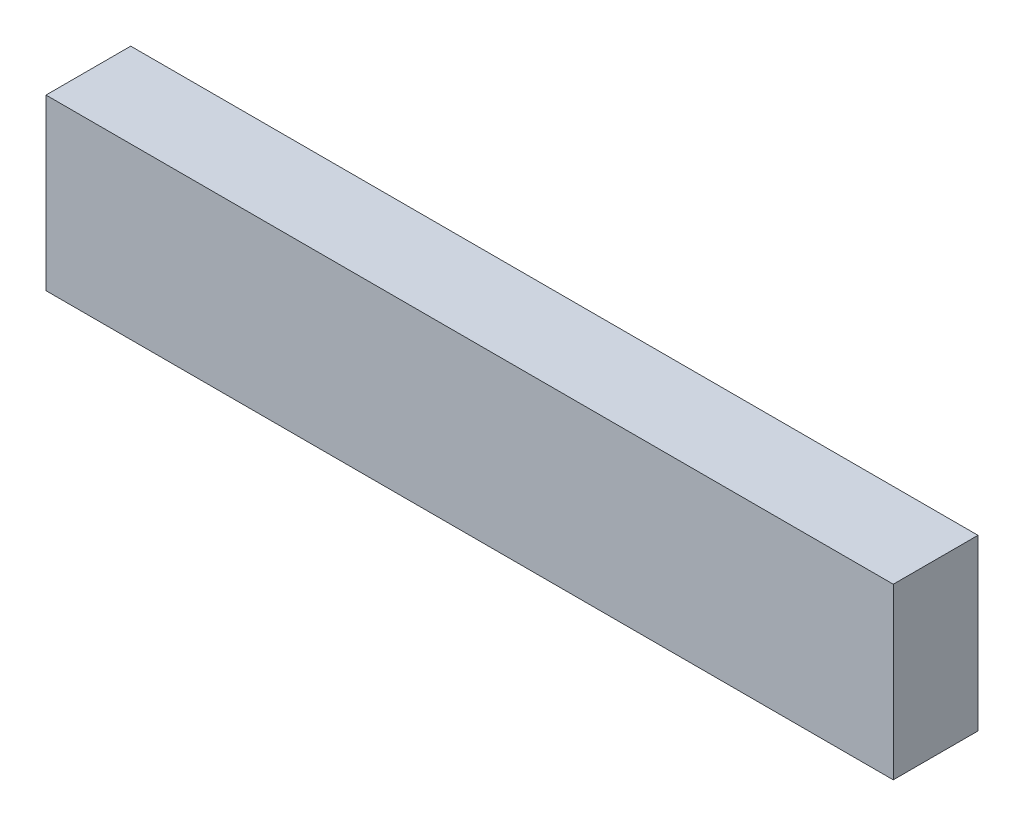
ISO-10303-21;
HEADER;
FILE_DESCRIPTION(('STEP AP214'),'2;1');
FILE_NAME('part.step','',(''),(''),'','','');
FILE_SCHEMA(('AUTOMOTIVE_DESIGN { 1 0 10303 214 1 1 1 1 }'));
ENDSEC;
DATA;
#1=APPLICATION_CONTEXT('core data for automotive mechanical design processes');
#2=APPLICATION_PROTOCOL_DEFINITION('international standard','automotive_design',2000,#1);
#3=PRODUCT_CONTEXT('',#1,'mechanical');
#4=PRODUCT('Part','Part','',(#3));
#5=PRODUCT_RELATED_PRODUCT_CATEGORY('part','',(#4));
#6=PRODUCT_DEFINITION_FORMATION('','',#4);
#7=PRODUCT_DEFINITION_CONTEXT('part definition',#1,'design');
#8=PRODUCT_DEFINITION('design','',#6,#7);
#9=PRODUCT_DEFINITION_SHAPE('','',#8);
#10=(LENGTH_UNIT() NAMED_UNIT(*) SI_UNIT(.MILLI.,.METRE.));
#11=(NAMED_UNIT(*) PLANE_ANGLE_UNIT() SI_UNIT($,.RADIAN.));
#12=(NAMED_UNIT(*) SI_UNIT($,.STERADIAN.) SOLID_ANGLE_UNIT());
#13=UNCERTAINTY_MEASURE_WITH_UNIT(LENGTH_MEASURE(1.E-05),#10,'distance_accuracy_value','');
#14=(GEOMETRIC_REPRESENTATION_CONTEXT(3) GLOBAL_UNCERTAINTY_ASSIGNED_CONTEXT((#13)) GLOBAL_UNIT_ASSIGNED_CONTEXT((#10,
#11,#12)) REPRESENTATION_CONTEXT('',''));
#15=CARTESIAN_POINT('',(0.,0.,0.));
#16=DIRECTION('',(0.,0.,1.));
#17=DIRECTION('',(1.,0.,0.));
#18=AXIS2_PLACEMENT_3D('',#15,#16,#17);
#19=CARTESIAN_POINT('',(0.,0.,5.));
#20=DIRECTION('',(1.,0.,0.));
#21=DIRECTION('',(0.,0.,-1.));
#22=AXIS2_PLACEMENT_3D('',#19,#20,#21);
#23=PLANE('',#22);
#24=DIRECTION('',(0.,-1.,0.));
#25=VECTOR('',#24,1.);
#26=CARTESIAN_POINT('',(0.,0.,0.));
#27=LINE('',#26,#25);
#28=CARTESIAN_POINT('',(0.,0.,0.));
#29=VERTEX_POINT('',#28);
#30=CARTESIAN_POINT('',(0.,-10.,0.));
#31=VERTEX_POINT('',#30);
#32=EDGE_CURVE('E107',#29,#31,#27,.T.);
#33=ORIENTED_EDGE('',*,*,#32,.T.);
#34=DIRECTION('',(0.,0.,-1.));
#35=VECTOR('',#34,1.);
#36=CARTESIAN_POINT('',(0.,-10.,5.));
#37=LINE('',#36,#35);
#38=CARTESIAN_POINT('',(0.,-10.,5.));
#39=VERTEX_POINT('',#38);
#40=EDGE_CURVE('E11',#39,#31,#37,.T.);
#41=ORIENTED_EDGE('',*,*,#40,.F.);
#42=DIRECTION('',(0.,-1.,0.));
#43=VECTOR('',#42,1.);
#44=CARTESIAN_POINT('',(0.,0.,5.));
#45=LINE('',#44,#43);
#46=CARTESIAN_POINT('',(0.,0.,5.));
#47=VERTEX_POINT('',#46);
#48=EDGE_CURVE('E91',#47,#39,#45,.T.);
#49=ORIENTED_EDGE('',*,*,#48,.F.);
#50=DIRECTION('',(0.,0.,-1.));
#51=VECTOR('',#50,1.);
#52=CARTESIAN_POINT('',(0.,0.,5.));
#53=LINE('',#52,#51);
#54=EDGE_CURVE('E103',#47,#29,#53,.T.);
#55=ORIENTED_EDGE('',*,*,#54,.T.);
#56=EDGE_LOOP('',(#33,#41,#49,#55));
#57=FACE_BOUND('',#56,.T.);
#58=ADVANCED_FACE('F39',(#57),#23,.F.);
#59=CARTESIAN_POINT('',(0.,-10.,5.));
#60=DIRECTION('',(0.,1.,0.));
#61=DIRECTION('',(0.,0.,1.));
#62=AXIS2_PLACEMENT_3D('',#59,#60,#61);
#63=PLANE('',#62);
#64=DIRECTION('',(1.,0.,0.));
#65=VECTOR('',#64,1.);
#66=CARTESIAN_POINT('',(0.,-10.,0.));
#67=LINE('',#66,#65);
#68=CARTESIAN_POINT('',(50.,-10.,0.));
#69=VERTEX_POINT('',#68);
#70=EDGE_CURVE('E96',#31,#69,#67,.T.);
#71=ORIENTED_EDGE('',*,*,#70,.T.);
#72=DIRECTION('',(0.,0.,-1.));
#73=VECTOR('',#72,1.);
#74=CARTESIAN_POINT('',(50.,-10.,5.));
#75=LINE('',#74,#73);
#76=CARTESIAN_POINT('',(50.,-10.,5.));
#77=VERTEX_POINT('',#76);
#78=EDGE_CURVE('E48',#77,#69,#75,.T.);
#79=ORIENTED_EDGE('',*,*,#78,.F.);
#80=DIRECTION('',(1.,0.,0.));
#81=VECTOR('',#80,1.);
#82=CARTESIAN_POINT('',(0.,-10.,5.));
#83=LINE('',#82,#81);
#84=EDGE_CURVE('E86',#39,#77,#83,.T.);
#85=ORIENTED_EDGE('',*,*,#84,.F.);
#86=ORIENTED_EDGE('',*,*,#40,.T.);
#87=EDGE_LOOP('',(#71,#79,#85,#86));
#88=FACE_BOUND('',#87,.T.);
#89=ADVANCED_FACE('F95',(#88),#63,.F.);
#90=CARTESIAN_POINT('',(50.,0.,5.));
#91=DIRECTION('',(-1.,0.,0.));
#92=DIRECTION('',(0.,0.,1.));
#93=AXIS2_PLACEMENT_3D('',#90,#91,#92);
#94=PLANE('',#93);
#95=DIRECTION('',(0.,1.,0.));
#96=VECTOR('',#95,1.);
#97=CARTESIAN_POINT('',(50.,0.,0.));
#98=LINE('',#97,#96);
#99=CARTESIAN_POINT('',(50.,0.,0.));
#100=VERTEX_POINT('',#99);
#101=EDGE_CURVE('E73',#69,#100,#98,.T.);
#102=ORIENTED_EDGE('',*,*,#101,.T.);
#103=DIRECTION('',(0.,0.,-1.));
#104=VECTOR('',#103,1.);
#105=CARTESIAN_POINT('',(50.,0.,5.));
#106=LINE('',#105,#104);
#107=CARTESIAN_POINT('',(50.,0.,5.));
#108=VERTEX_POINT('',#107);
#109=EDGE_CURVE('E98',#108,#100,#106,.T.);
#110=ORIENTED_EDGE('',*,*,#109,.F.);
#111=DIRECTION('',(0.,1.,0.));
#112=VECTOR('',#111,1.);
#113=CARTESIAN_POINT('',(50.,0.,5.));
#114=LINE('',#113,#112);
#115=EDGE_CURVE('E89',#77,#108,#114,.T.);
#116=ORIENTED_EDGE('',*,*,#115,.F.);
#117=ORIENTED_EDGE('',*,*,#78,.T.);
#118=EDGE_LOOP('',(#102,#110,#116,#117));
#119=FACE_BOUND('',#118,.T.);
#120=ADVANCED_FACE('F99',(#119),#94,.F.);
#121=CARTESIAN_POINT('',(0.,0.,5.));
#122=DIRECTION('',(0.,-1.,0.));
#123=DIRECTION('',(0.,0.,-1.));
#124=AXIS2_PLACEMENT_3D('',#121,#122,#123);
#125=PLANE('',#124);
#126=DIRECTION('',(-1.,0.,0.));
#127=VECTOR('',#126,1.);
#128=CARTESIAN_POINT('',(0.,0.,0.));
#129=LINE('',#128,#127);
#130=EDGE_CURVE('E79',#100,#29,#129,.T.);
#131=ORIENTED_EDGE('',*,*,#130,.T.);
#132=ORIENTED_EDGE('',*,*,#54,.F.);
#133=DIRECTION('',(-1.,0.,0.));
#134=VECTOR('',#133,1.);
#135=CARTESIAN_POINT('',(0.,0.,5.));
#136=LINE('',#135,#134);
#137=EDGE_CURVE('E56',#108,#47,#136,.T.);
#138=ORIENTED_EDGE('',*,*,#137,.F.);
#139=ORIENTED_EDGE('',*,*,#109,.T.);
#140=EDGE_LOOP('',(#131,#132,#138,#139));
#141=FACE_BOUND('',#140,.T.);
#142=ADVANCED_FACE('F120',(#141),#125,.F.);
#143=CARTESIAN_POINT('',(0.,0.,5.));
#144=DIRECTION('',(0.,0.,1.));
#145=DIRECTION('',(1.,0.,0.));
#146=AXIS2_PLACEMENT_3D('',#143,#144,#145);
#147=PLANE('',#146);
#148=ORIENTED_EDGE('',*,*,#48,.T.);
#149=ORIENTED_EDGE('',*,*,#84,.T.);
#150=ORIENTED_EDGE('',*,*,#115,.T.);
#151=ORIENTED_EDGE('',*,*,#137,.T.);
#152=EDGE_LOOP('',(#148,#149,#150,#151));
#153=FACE_BOUND('',#152,.T.);
#154=ADVANCED_FACE('F87',(#153),#147,.T.);
#155=CARTESIAN_POINT('',(0.,0.,0.));
#156=DIRECTION('',(0.,0.,1.));
#157=DIRECTION('',(1.,0.,0.));
#158=AXIS2_PLACEMENT_3D('',#155,#156,#157);
#159=PLANE('',#158);
#160=ORIENTED_EDGE('',*,*,#32,.F.);
#161=ORIENTED_EDGE('',*,*,#130,.F.);
#162=ORIENTED_EDGE('',*,*,#101,.F.);
#163=ORIENTED_EDGE('',*,*,#70,.F.);
#164=EDGE_LOOP('',(#160,#161,#162,#163));
#165=FACE_BOUND('',#164,.T.);
#166=ADVANCED_FACE('F123',(#165),#159,.F.);
#167=CLOSED_SHELL('',(#58,#89,#120,#142,#154,#166));
#168=MANIFOLD_SOLID_BREP('B2',#167);
#169=ADVANCED_BREP_SHAPE_REPRESENTATION('',(#18,#168),#14);
#170=SHAPE_DEFINITION_REPRESENTATION(#9,#169);
ENDSEC;
END-ISO-10303-21;
